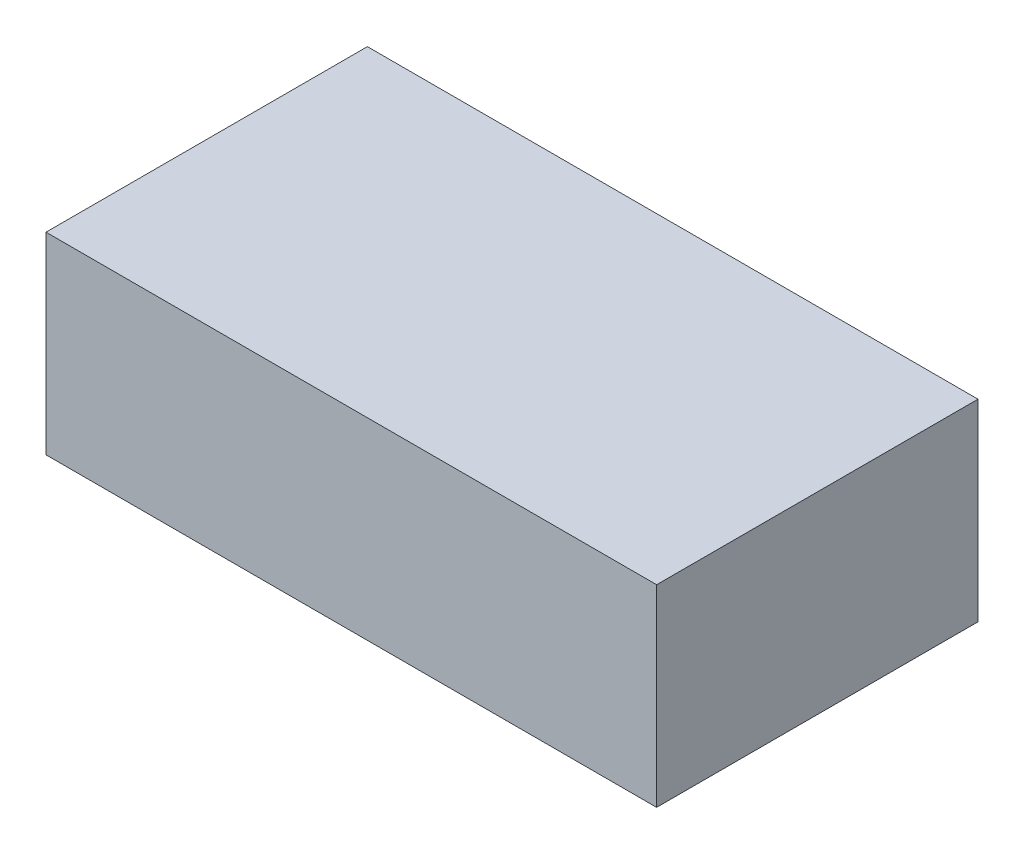
ISO-10303-21;
HEADER;
FILE_DESCRIPTION(('STEP AP214'),'2;1');
FILE_NAME('part.step','',(''),(''),'','','');
FILE_SCHEMA(('AUTOMOTIVE_DESIGN { 1 0 10303 214 1 1 1 1 }'));
ENDSEC;
DATA;
#1=APPLICATION_CONTEXT('core data for automotive mechanical design processes');
#2=APPLICATION_PROTOCOL_DEFINITION('international standard','automotive_design',2000,#1);
#3=PRODUCT_CONTEXT('',#1,'mechanical');
#4=PRODUCT('Part','Part','',(#3));
#5=PRODUCT_RELATED_PRODUCT_CATEGORY('part','',(#4));
#6=PRODUCT_DEFINITION_FORMATION('','',#4);
#7=PRODUCT_DEFINITION_CONTEXT('part definition',#1,'design');
#8=PRODUCT_DEFINITION('design','',#6,#7);
#9=PRODUCT_DEFINITION_SHAPE('','',#8);
#10=(LENGTH_UNIT() NAMED_UNIT(*) SI_UNIT(.MILLI.,.METRE.));
#11=(NAMED_UNIT(*) PLANE_ANGLE_UNIT() SI_UNIT($,.RADIAN.));
#12=(NAMED_UNIT(*) SI_UNIT($,.STERADIAN.) SOLID_ANGLE_UNIT());
#13=UNCERTAINTY_MEASURE_WITH_UNIT(LENGTH_MEASURE(1.E-05),#10,'distance_accuracy_value','');
#14=(GEOMETRIC_REPRESENTATION_CONTEXT(3) GLOBAL_UNCERTAINTY_ASSIGNED_CONTEXT((#13)) GLOBAL_UNIT_ASSIGNED_CONTEXT((#10,
#11,#12)) REPRESENTATION_CONTEXT('',''));
#15=CARTESIAN_POINT('',(0.,0.,0.));
#16=DIRECTION('',(0.,0.,1.));
#17=DIRECTION('',(1.,0.,0.));
#18=AXIS2_PLACEMENT_3D('',#15,#16,#17);
#19=CARTESIAN_POINT('',(0.47500032,0.1499997,0.));
#20=DIRECTION('',(0.,-1.,0.));
#21=DIRECTION('',(0.,0.,-1.));
#22=AXIS2_PLACEMENT_3D('',#19,#20,#21);
#23=PLANE('',#22);
#24=DIRECTION('',(0.,0.,-1.));
#25=VECTOR('',#24,1.);
#26=CARTESIAN_POINT('',(-0.47500032,0.1499997,0.));
#27=LINE('',#26,#25);
#28=CARTESIAN_POINT('',(-0.47500032,0.1499997,0.));
#29=VERTEX_POINT('',#28);
#30=CARTESIAN_POINT('',(-0.47500032,0.1499997,0.499999));
#31=VERTEX_POINT('',#30);
#32=EDGE_CURVE('E19',#29,#31,#27,.F.);
#33=ORIENTED_EDGE('',*,*,#32,.T.);
#34=DIRECTION('',(-1.,0.,0.));
#35=VECTOR('',#34,1.);
#36=CARTESIAN_POINT('',(-0.47500032,0.1499997,0.499999));
#37=LINE('',#36,#35);
#38=CARTESIAN_POINT('',(0.47500032,0.1499997,0.499999));
#39=VERTEX_POINT('',#38);
#40=EDGE_CURVE('E54',#31,#39,#37,.F.);
#41=ORIENTED_EDGE('',*,*,#40,.T.);
#42=DIRECTION('',(0.,0.,1.));
#43=VECTOR('',#42,1.);
#44=CARTESIAN_POINT('',(0.47500032,0.1499997,0.));
#45=LINE('',#44,#43);
#46=CARTESIAN_POINT('',(0.47500032,0.1499997,0.));
#47=VERTEX_POINT('',#46);
#48=EDGE_CURVE('E75',#39,#47,#45,.F.);
#49=ORIENTED_EDGE('',*,*,#48,.T.);
#50=DIRECTION('',(-1.,0.,0.));
#51=VECTOR('',#50,1.);
#52=CARTESIAN_POINT('',(-0.47500032,0.1499997,0.));
#53=LINE('',#52,#51);
#54=EDGE_CURVE('E57',#29,#47,#53,.F.);
#55=ORIENTED_EDGE('',*,*,#54,.F.);
#56=EDGE_LOOP('',(#33,#41,#49,#55));
#57=FACE_BOUND('',#56,.T.);
#58=ADVANCED_FACE('F16',(#57),#23,.F.);
#59=CARTESIAN_POINT('',(-0.47500032,0.1499997,0.));
#60=DIRECTION('',(1.,0.,0.));
#61=DIRECTION('',(0.,0.,-1.));
#62=AXIS2_PLACEMENT_3D('',#59,#60,#61);
#63=PLANE('',#62);
#64=DIRECTION('',(0.,0.,1.));
#65=VECTOR('',#64,1.);
#66=CARTESIAN_POINT('',(-0.47500032,-0.1499997,0.));
#67=LINE('',#66,#65);
#68=CARTESIAN_POINT('',(-0.47500032,-0.1499997,0.));
#69=VERTEX_POINT('',#68);
#70=CARTESIAN_POINT('',(-0.47500032,-0.1499997,0.499999));
#71=VERTEX_POINT('',#70);
#72=EDGE_CURVE('E72',#69,#71,#67,.T.);
#73=ORIENTED_EDGE('',*,*,#72,.T.);
#74=DIRECTION('',(0.,1.,0.));
#75=VECTOR('',#74,1.);
#76=CARTESIAN_POINT('',(-0.47500032,-0.1499997,0.499999));
#77=LINE('',#76,#75);
#78=EDGE_CURVE('E62',#71,#31,#77,.T.);
#79=ORIENTED_EDGE('',*,*,#78,.T.);
#80=ORIENTED_EDGE('',*,*,#32,.F.);
#81=DIRECTION('',(0.,1.,0.));
#82=VECTOR('',#81,1.);
#83=CARTESIAN_POINT('',(-0.47500032,-0.1499997,0.));
#84=LINE('',#83,#82);
#85=EDGE_CURVE('E77',#69,#29,#84,.T.);
#86=ORIENTED_EDGE('',*,*,#85,.F.);
#87=EDGE_LOOP('',(#73,#79,#80,#86));
#88=FACE_BOUND('',#87,.T.);
#89=ADVANCED_FACE('F71',(#88),#63,.F.);
#90=CARTESIAN_POINT('',(-0.47500032,-0.1499997,0.499999));
#91=DIRECTION('',(0.,0.,-1.));
#92=DIRECTION('',(-1.,0.,0.));
#93=AXIS2_PLACEMENT_3D('',#90,#91,#92);
#94=PLANE('',#93);
#95=DIRECTION('',(0.,1.,0.));
#96=VECTOR('',#95,1.);
#97=CARTESIAN_POINT('',(0.47500032,-0.1499997,0.499999));
#98=LINE('',#97,#96);
#99=CARTESIAN_POINT('',(0.47500032,-0.1499997,0.499999));
#100=VERTEX_POINT('',#99);
#101=EDGE_CURVE('E68',#100,#39,#98,.T.);
#102=ORIENTED_EDGE('',*,*,#101,.T.);
#103=ORIENTED_EDGE('',*,*,#40,.F.);
#104=ORIENTED_EDGE('',*,*,#78,.F.);
#105=DIRECTION('',(1.,0.,0.));
#106=VECTOR('',#105,1.);
#107=CARTESIAN_POINT('',(-0.47500032,-0.1499997,0.499999));
#108=LINE('',#107,#106);
#109=EDGE_CURVE('E82',#71,#100,#108,.T.);
#110=ORIENTED_EDGE('',*,*,#109,.T.);
#111=EDGE_LOOP('',(#102,#103,#104,#110));
#112=FACE_BOUND('',#111,.T.);
#113=ADVANCED_FACE('F65',(#112),#94,.F.);
#114=CARTESIAN_POINT('',(0.47500032,-0.1499997,0.));
#115=DIRECTION('',(-1.,0.,0.));
#116=DIRECTION('',(0.,0.,1.));
#117=AXIS2_PLACEMENT_3D('',#114,#115,#116);
#118=PLANE('',#117);
#119=ORIENTED_EDGE('',*,*,#48,.F.);
#120=ORIENTED_EDGE('',*,*,#101,.F.);
#121=DIRECTION('',(0.,0.,1.));
#122=VECTOR('',#121,1.);
#123=CARTESIAN_POINT('',(0.47500032,-0.1499997,0.));
#124=LINE('',#123,#122);
#125=CARTESIAN_POINT('',(0.47500032,-0.1499997,0.));
#126=VERTEX_POINT('',#125);
#127=EDGE_CURVE('E25',#100,#126,#124,.F.);
#128=ORIENTED_EDGE('',*,*,#127,.T.);
#129=DIRECTION('',(0.,1.,0.));
#130=VECTOR('',#129,1.);
#131=CARTESIAN_POINT('',(0.47500032,-0.1499997,0.));
#132=LINE('',#131,#130);
#133=EDGE_CURVE('E33',#47,#126,#132,.F.);
#134=ORIENTED_EDGE('',*,*,#133,.F.);
#135=EDGE_LOOP('',(#119,#120,#128,#134));
#136=FACE_BOUND('',#135,.T.);
#137=ADVANCED_FACE('F87',(#136),#118,.F.);
#138=CARTESIAN_POINT('',(-0.47500032,-0.1499997,0.));
#139=DIRECTION('',(0.,0.,-1.));
#140=DIRECTION('',(-1.,0.,0.));
#141=AXIS2_PLACEMENT_3D('',#138,#139,#140);
#142=PLANE('',#141);
#143=ORIENTED_EDGE('',*,*,#133,.T.);
#144=DIRECTION('',(1.,0.,0.));
#145=VECTOR('',#144,1.);
#146=CARTESIAN_POINT('',(-0.47500032,-0.1499997,0.));
#147=LINE('',#146,#145);
#148=EDGE_CURVE('E11',#126,#69,#147,.F.);
#149=ORIENTED_EDGE('',*,*,#148,.T.);
#150=ORIENTED_EDGE('',*,*,#85,.T.);
#151=ORIENTED_EDGE('',*,*,#54,.T.);
#152=EDGE_LOOP('',(#143,#149,#150,#151));
#153=FACE_BOUND('',#152,.T.);
#154=ADVANCED_FACE('F90',(#153),#142,.T.);
#155=CARTESIAN_POINT('',(-0.47500032,-0.1499997,0.));
#156=DIRECTION('',(0.,1.,0.));
#157=DIRECTION('',(0.,0.,1.));
#158=AXIS2_PLACEMENT_3D('',#155,#156,#157);
#159=PLANE('',#158);
#160=ORIENTED_EDGE('',*,*,#127,.F.);
#161=ORIENTED_EDGE('',*,*,#109,.F.);
#162=ORIENTED_EDGE('',*,*,#72,.F.);
#163=ORIENTED_EDGE('',*,*,#148,.F.);
#164=EDGE_LOOP('',(#160,#161,#162,#163));
#165=FACE_BOUND('',#164,.T.);
#166=ADVANCED_FACE('F89',(#165),#159,.F.);
#167=CLOSED_SHELL('',(#58,#89,#113,#137,#154,#166));
#168=MANIFOLD_SOLID_BREP('B1',#167);
#169=ADVANCED_BREP_SHAPE_REPRESENTATION('',(#18,#168),#14);
#170=SHAPE_DEFINITION_REPRESENTATION(#9,#169);
ENDSEC;
END-ISO-10303-21;
